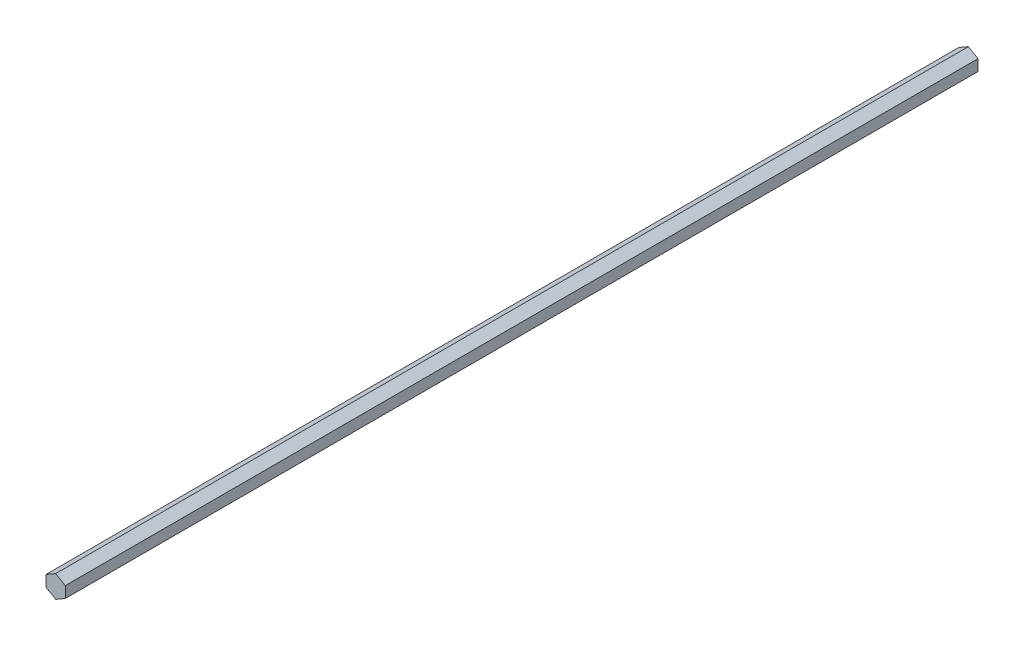
ISO-10303-21;
HEADER;
FILE_DESCRIPTION(('STEP AP214'),'2;1');
FILE_NAME('part.step','',(''),(''),'','','');
FILE_SCHEMA(('AUTOMOTIVE_DESIGN { 1 0 10303 214 1 1 1 1 }'));
ENDSEC;
DATA;
#1=APPLICATION_CONTEXT('core data for automotive mechanical design processes');
#2=APPLICATION_PROTOCOL_DEFINITION('international standard','automotive_design',2000,#1);
#3=PRODUCT_CONTEXT('',#1,'mechanical');
#4=PRODUCT('Part','Part','',(#3));
#5=PRODUCT_RELATED_PRODUCT_CATEGORY('part','',(#4));
#6=PRODUCT_DEFINITION_FORMATION('','',#4);
#7=PRODUCT_DEFINITION_CONTEXT('part definition',#1,'design');
#8=PRODUCT_DEFINITION('design','',#6,#7);
#9=PRODUCT_DEFINITION_SHAPE('','',#8);
#10=(LENGTH_UNIT() NAMED_UNIT(*) SI_UNIT(.MILLI.,.METRE.));
#11=(NAMED_UNIT(*) PLANE_ANGLE_UNIT() SI_UNIT($,.RADIAN.));
#12=(NAMED_UNIT(*) SI_UNIT($,.STERADIAN.) SOLID_ANGLE_UNIT());
#13=UNCERTAINTY_MEASURE_WITH_UNIT(LENGTH_MEASURE(1.E-05),#10,'distance_accuracy_value','');
#14=(GEOMETRIC_REPRESENTATION_CONTEXT(3) GLOBAL_UNCERTAINTY_ASSIGNED_CONTEXT((#13)) GLOBAL_UNIT_ASSIGNED_CONTEXT((#10,
#11,#12)) REPRESENTATION_CONTEXT('',''));
#15=CARTESIAN_POINT('',(0.,0.,0.));
#16=DIRECTION('',(0.,0.,1.));
#17=DIRECTION('',(1.,0.,0.));
#18=AXIS2_PLACEMENT_3D('',#15,#16,#17);
#19=CARTESIAN_POINT('',(-4.76313972081445,-2.75000000000002,450.));
#20=DIRECTION('',(0.5,0.866025403784439,0.));
#21=DIRECTION('',(-0.866025403784439,0.5,0.));
#22=AXIS2_PLACEMENT_3D('',#19,#20,#21);
#23=PLANE('',#22);
#24=DIRECTION('',(0.866025403784439,-0.5,0.));
#25=VECTOR('',#24,1.);
#26=CARTESIAN_POINT('',(-4.76313972081445,-2.75000000000002,0.));
#27=LINE('',#26,#25);
#28=CARTESIAN_POINT('',(-4.76313972081445,-2.75000000000002,0.));
#29=VERTEX_POINT('',#28);
#30=CARTESIAN_POINT('',(0.,-5.50000000000004,0.));
#31=VERTEX_POINT('',#30);
#32=EDGE_CURVE('E120',#29,#31,#27,.T.);
#33=ORIENTED_EDGE('',*,*,#32,.T.);
#34=DIRECTION('',(0.,0.,-1.));
#35=VECTOR('',#34,1.);
#36=CARTESIAN_POINT('',(0.,-5.50000000000004,450.));
#37=LINE('',#36,#35);
#38=CARTESIAN_POINT('',(0.,-5.50000000000004,450.));
#39=VERTEX_POINT('',#38);
#40=EDGE_CURVE('E11',#39,#31,#37,.T.);
#41=ORIENTED_EDGE('',*,*,#40,.F.);
#42=DIRECTION('',(0.866025403784439,-0.5,0.));
#43=VECTOR('',#42,1.);
#44=CARTESIAN_POINT('',(-4.76313972081445,-2.75000000000002,450.));
#45=LINE('',#44,#43);
#46=CARTESIAN_POINT('',(-4.76313972081445,-2.75000000000002,450.));
#47=VERTEX_POINT('',#46);
#48=EDGE_CURVE('E130',#47,#39,#45,.T.);
#49=ORIENTED_EDGE('',*,*,#48,.F.);
#50=DIRECTION('',(0.,0.,-1.));
#51=VECTOR('',#50,1.);
#52=CARTESIAN_POINT('',(-4.76313972081445,-2.75000000000002,450.));
#53=LINE('',#52,#51);
#54=EDGE_CURVE('E116',#47,#29,#53,.T.);
#55=ORIENTED_EDGE('',*,*,#54,.T.);
#56=EDGE_LOOP('',(#33,#41,#49,#55));
#57=FACE_BOUND('',#56,.T.);
#58=ADVANCED_FACE('F36',(#57),#23,.F.);
#59=CARTESIAN_POINT('',(0.,-5.50000000000004,450.));
#60=DIRECTION('',(-0.5,0.866025403784439,0.));
#61=DIRECTION('',(-0.866025403784439,-0.5,0.));
#62=AXIS2_PLACEMENT_3D('',#59,#60,#61);
#63=PLANE('',#62);
#64=DIRECTION('',(0.866025403784439,0.5,0.));
#65=VECTOR('',#64,1.);
#66=CARTESIAN_POINT('',(0.,-5.50000000000004,0.));
#67=LINE('',#66,#65);
#68=CARTESIAN_POINT('',(4.76313972081445,-2.75000000000002,0.));
#69=VERTEX_POINT('',#68);
#70=EDGE_CURVE('E123',#31,#69,#67,.T.);
#71=ORIENTED_EDGE('',*,*,#70,.T.);
#72=DIRECTION('',(0.,0.,-1.));
#73=VECTOR('',#72,1.);
#74=CARTESIAN_POINT('',(4.76313972081445,-2.75000000000002,450.));
#75=LINE('',#74,#73);
#76=CARTESIAN_POINT('',(4.76313972081445,-2.75000000000002,450.));
#77=VERTEX_POINT('',#76);
#78=EDGE_CURVE('E44',#77,#69,#75,.T.);
#79=ORIENTED_EDGE('',*,*,#78,.F.);
#80=DIRECTION('',(0.866025403784439,0.5,0.));
#81=VECTOR('',#80,1.);
#82=CARTESIAN_POINT('',(0.,-5.50000000000004,450.));
#83=LINE('',#82,#81);
#84=EDGE_CURVE('E89',#39,#77,#83,.T.);
#85=ORIENTED_EDGE('',*,*,#84,.F.);
#86=ORIENTED_EDGE('',*,*,#40,.T.);
#87=EDGE_LOOP('',(#71,#79,#85,#86));
#88=FACE_BOUND('',#87,.T.);
#89=ADVANCED_FACE('F154',(#88),#63,.F.);
#90=CARTESIAN_POINT('',(4.76313972081445,-2.75000000000002,450.));
#91=DIRECTION('',(-1.,0.,0.));
#92=DIRECTION('',(0.,-1.,0.));
#93=AXIS2_PLACEMENT_3D('',#90,#91,#92);
#94=PLANE('',#93);
#95=DIRECTION('',(0.,1.,0.));
#96=VECTOR('',#95,1.);
#97=CARTESIAN_POINT('',(4.76313972081445,-2.75000000000002,0.));
#98=LINE('',#97,#96);
#99=CARTESIAN_POINT('',(4.76313972081445,2.75000000000003,0.));
#100=VERTEX_POINT('',#99);
#101=EDGE_CURVE('E125',#69,#100,#98,.T.);
#102=ORIENTED_EDGE('',*,*,#101,.T.);
#103=DIRECTION('',(0.,0.,-1.));
#104=VECTOR('',#103,1.);
#105=CARTESIAN_POINT('',(4.76313972081445,2.75000000000003,450.));
#106=LINE('',#105,#104);
#107=CARTESIAN_POINT('',(4.76313972081445,2.75000000000003,450.));
#108=VERTEX_POINT('',#107);
#109=EDGE_CURVE('E111',#108,#100,#106,.T.);
#110=ORIENTED_EDGE('',*,*,#109,.F.);
#111=DIRECTION('',(0.,1.,0.));
#112=VECTOR('',#111,1.);
#113=CARTESIAN_POINT('',(4.76313972081445,-2.75000000000002,450.));
#114=LINE('',#113,#112);
#115=EDGE_CURVE('E102',#77,#108,#114,.T.);
#116=ORIENTED_EDGE('',*,*,#115,.F.);
#117=ORIENTED_EDGE('',*,*,#78,.T.);
#118=EDGE_LOOP('',(#102,#110,#116,#117));
#119=FACE_BOUND('',#118,.T.);
#120=ADVANCED_FACE('F136',(#119),#94,.F.);
#121=CARTESIAN_POINT('',(4.76313972081445,2.75000000000003,450.));
#122=DIRECTION('',(-0.5,-0.866025403784439,0.));
#123=DIRECTION('',(0.866025403784439,-0.5,0.));
#124=AXIS2_PLACEMENT_3D('',#121,#122,#123);
#125=PLANE('',#124);
#126=DIRECTION('',(-0.866025403784439,0.5,0.));
#127=VECTOR('',#126,1.);
#128=CARTESIAN_POINT('',(4.76313972081445,2.75000000000003,0.));
#129=LINE('',#128,#127);
#130=CARTESIAN_POINT('',(0.,5.50000000000005,0.));
#131=VERTEX_POINT('',#130);
#132=EDGE_CURVE('E110',#100,#131,#129,.T.);
#133=ORIENTED_EDGE('',*,*,#132,.T.);
#134=DIRECTION('',(0.,0.,-1.));
#135=VECTOR('',#134,1.);
#136=CARTESIAN_POINT('',(0.,5.50000000000005,450.));
#137=LINE('',#136,#135);
#138=CARTESIAN_POINT('',(0.,5.50000000000005,450.));
#139=VERTEX_POINT('',#138);
#140=EDGE_CURVE('E107',#139,#131,#137,.T.);
#141=ORIENTED_EDGE('',*,*,#140,.F.);
#142=DIRECTION('',(-0.866025403784439,0.5,0.));
#143=VECTOR('',#142,1.);
#144=CARTESIAN_POINT('',(4.76313972081445,2.75000000000003,450.));
#145=LINE('',#144,#143);
#146=EDGE_CURVE('E96',#108,#139,#145,.T.);
#147=ORIENTED_EDGE('',*,*,#146,.F.);
#148=ORIENTED_EDGE('',*,*,#109,.T.);
#149=EDGE_LOOP('',(#133,#141,#147,#148));
#150=FACE_BOUND('',#149,.T.);
#151=ADVANCED_FACE('F108',(#150),#125,.F.);
#152=CARTESIAN_POINT('',(0.,5.50000000000005,450.));
#153=DIRECTION('',(0.5,-0.866025403784439,0.));
#154=DIRECTION('',(0.866025403784439,0.5,0.));
#155=AXIS2_PLACEMENT_3D('',#152,#153,#154);
#156=PLANE('',#155);
#157=DIRECTION('',(-0.866025403784439,-0.5,0.));
#158=VECTOR('',#157,1.);
#159=CARTESIAN_POINT('',(0.,5.50000000000005,0.));
#160=LINE('',#159,#158);
#161=CARTESIAN_POINT('',(-4.76313972081445,2.75000000000003,0.));
#162=VERTEX_POINT('',#161);
#163=EDGE_CURVE('E75',#131,#162,#160,.T.);
#164=ORIENTED_EDGE('',*,*,#163,.T.);
#165=DIRECTION('',(0.,0.,-1.));
#166=VECTOR('',#165,1.);
#167=CARTESIAN_POINT('',(-4.76313972081445,2.75000000000003,450.));
#168=LINE('',#167,#166);
#169=CARTESIAN_POINT('',(-4.76313972081445,2.75000000000003,450.));
#170=VERTEX_POINT('',#169);
#171=EDGE_CURVE('E112',#170,#162,#168,.T.);
#172=ORIENTED_EDGE('',*,*,#171,.F.);
#173=DIRECTION('',(-0.866025403784439,-0.5,0.));
#174=VECTOR('',#173,1.);
#175=CARTESIAN_POINT('',(0.,5.50000000000005,450.));
#176=LINE('',#175,#174);
#177=EDGE_CURVE('E100',#139,#170,#176,.T.);
#178=ORIENTED_EDGE('',*,*,#177,.F.);
#179=ORIENTED_EDGE('',*,*,#140,.T.);
#180=EDGE_LOOP('',(#164,#172,#178,#179));
#181=FACE_BOUND('',#180,.T.);
#182=ADVANCED_FACE('F114',(#181),#156,.F.);
#183=CARTESIAN_POINT('',(-4.76313972081445,2.75000000000003,450.));
#184=DIRECTION('',(1.,0.,0.));
#185=DIRECTION('',(0.,0.,-1.));
#186=AXIS2_PLACEMENT_3D('',#183,#184,#185);
#187=PLANE('',#186);
#188=DIRECTION('',(0.,-1.,0.));
#189=VECTOR('',#188,1.);
#190=CARTESIAN_POINT('',(-4.76313972081445,2.75000000000003,0.));
#191=LINE('',#190,#189);
#192=EDGE_CURVE('E81',#162,#29,#191,.T.);
#193=ORIENTED_EDGE('',*,*,#192,.T.);
#194=ORIENTED_EDGE('',*,*,#54,.F.);
#195=DIRECTION('',(0.,-1.,0.));
#196=VECTOR('',#195,1.);
#197=CARTESIAN_POINT('',(-4.76313972081445,2.75000000000003,450.));
#198=LINE('',#197,#196);
#199=EDGE_CURVE('E52',#170,#47,#198,.T.);
#200=ORIENTED_EDGE('',*,*,#199,.F.);
#201=ORIENTED_EDGE('',*,*,#171,.T.);
#202=EDGE_LOOP('',(#193,#194,#200,#201));
#203=FACE_BOUND('',#202,.T.);
#204=ADVANCED_FACE('F143',(#203),#187,.F.);
#205=CARTESIAN_POINT('',(0.,0.,450.));
#206=DIRECTION('',(0.,0.,1.));
#207=DIRECTION('',(1.,0.,0.));
#208=AXIS2_PLACEMENT_3D('',#205,#206,#207);
#209=PLANE('',#208);
#210=ORIENTED_EDGE('',*,*,#48,.T.);
#211=ORIENTED_EDGE('',*,*,#84,.T.);
#212=ORIENTED_EDGE('',*,*,#115,.T.);
#213=ORIENTED_EDGE('',*,*,#146,.T.);
#214=ORIENTED_EDGE('',*,*,#177,.T.);
#215=ORIENTED_EDGE('',*,*,#199,.T.);
#216=EDGE_LOOP('',(#210,#211,#212,#213,#214,#215));
#217=FACE_BOUND('',#216,.T.);
#218=ADVANCED_FACE('F98',(#217),#209,.T.);
#219=CARTESIAN_POINT('',(0.,0.,0.));
#220=DIRECTION('',(0.,0.,1.));
#221=DIRECTION('',(1.,0.,0.));
#222=AXIS2_PLACEMENT_3D('',#219,#220,#221);
#223=PLANE('',#222);
#224=ORIENTED_EDGE('',*,*,#32,.F.);
#225=ORIENTED_EDGE('',*,*,#192,.F.);
#226=ORIENTED_EDGE('',*,*,#163,.F.);
#227=ORIENTED_EDGE('',*,*,#132,.F.);
#228=ORIENTED_EDGE('',*,*,#101,.F.);
#229=ORIENTED_EDGE('',*,*,#70,.F.);
#230=EDGE_LOOP('',(#224,#225,#226,#227,#228,#229));
#231=FACE_BOUND('',#230,.T.);
#232=ADVANCED_FACE('F139',(#231),#223,.F.);
#233=CLOSED_SHELL('',(#58,#89,#120,#151,#182,#204,#218,#232));
#234=MANIFOLD_SOLID_BREP('B2',#233);
#235=ADVANCED_BREP_SHAPE_REPRESENTATION('',(#18,#234),#14);
#236=SHAPE_DEFINITION_REPRESENTATION(#9,#235);
ENDSEC;
END-ISO-10303-21;
